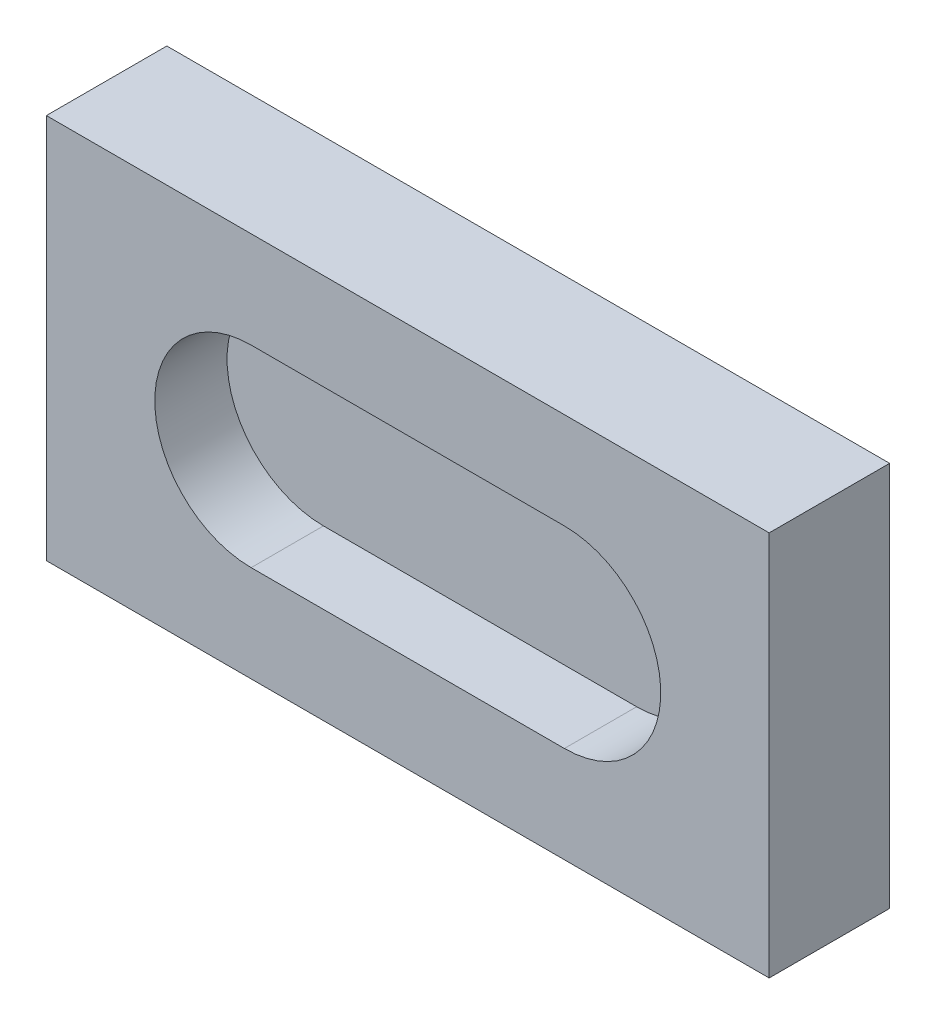
ISO-10303-21;
HEADER;
FILE_DESCRIPTION(('STEP AP214'),'2;1');
FILE_NAME('part.step','',(''),(''),'','','');
FILE_SCHEMA(('AUTOMOTIVE_DESIGN { 1 0 10303 214 1 1 1 1 }'));
ENDSEC;
DATA;
#1=APPLICATION_CONTEXT('core data for automotive mechanical design processes');
#2=APPLICATION_PROTOCOL_DEFINITION('international standard','automotive_design',2000,#1);
#3=PRODUCT_CONTEXT('',#1,'mechanical');
#4=PRODUCT('Part','Part','',(#3));
#5=PRODUCT_RELATED_PRODUCT_CATEGORY('part','',(#4));
#6=PRODUCT_DEFINITION_FORMATION('','',#4);
#7=PRODUCT_DEFINITION_CONTEXT('part definition',#1,'design');
#8=PRODUCT_DEFINITION('design','',#6,#7);
#9=PRODUCT_DEFINITION_SHAPE('','',#8);
#10=(LENGTH_UNIT() NAMED_UNIT(*) SI_UNIT(.MILLI.,.METRE.));
#11=(NAMED_UNIT(*) PLANE_ANGLE_UNIT() SI_UNIT($,.RADIAN.));
#12=(NAMED_UNIT(*) SI_UNIT($,.STERADIAN.) SOLID_ANGLE_UNIT());
#13=UNCERTAINTY_MEASURE_WITH_UNIT(LENGTH_MEASURE(1.E-05),#10,'distance_accuracy_value','');
#14=(GEOMETRIC_REPRESENTATION_CONTEXT(3) GLOBAL_UNCERTAINTY_ASSIGNED_CONTEXT((#13)) GLOBAL_UNIT_ASSIGNED_CONTEXT((#10,
#11,#12)) REPRESENTATION_CONTEXT('',''));
#15=CARTESIAN_POINT('',(0.,0.,0.));
#16=DIRECTION('',(0.,0.,1.));
#17=DIRECTION('',(1.,0.,0.));
#18=AXIS2_PLACEMENT_3D('',#15,#16,#17);
#19=CARTESIAN_POINT('',(75.,52.5,12.5000000000002));
#20=DIRECTION('',(-1.,0.,0.));
#21=DIRECTION('',(0.,-1.,0.));
#22=AXIS2_PLACEMENT_3D('',#19,#20,#21);
#23=PLANE('',#22);
#24=DIRECTION('',(0.,1.,0.));
#25=VECTOR('',#24,1.);
#26=CARTESIAN_POINT('',(75.,52.5,-12.4999999999998));
#27=LINE('',#26,#25);
#28=CARTESIAN_POINT('',(75.,-27.5,-12.5000000000001));
#29=VERTEX_POINT('',#28);
#30=CARTESIAN_POINT('',(75.,52.5,-12.4999999999998));
#31=VERTEX_POINT('',#30);
#32=EDGE_CURVE('E184',#29,#31,#27,.T.);
#33=ORIENTED_EDGE('',*,*,#32,.T.);
#34=DIRECTION('',(0.,0.,-1.));
#35=VECTOR('',#34,1.);
#36=CARTESIAN_POINT('',(75.,52.5,12.5000000000002));
#37=LINE('',#36,#35);
#38=CARTESIAN_POINT('',(75.,52.5,12.5000000000002));
#39=VERTEX_POINT('',#38);
#40=EDGE_CURVE('E12',#39,#31,#37,.T.);
#41=ORIENTED_EDGE('',*,*,#40,.F.);
#42=DIRECTION('',(0.,1.,0.));
#43=VECTOR('',#42,1.);
#44=CARTESIAN_POINT('',(75.,52.5,12.5000000000002));
#45=LINE('',#44,#43);
#46=CARTESIAN_POINT('',(75.,-27.5,12.4999999999999));
#47=VERTEX_POINT('',#46);
#48=EDGE_CURVE('E193',#47,#39,#45,.T.);
#49=ORIENTED_EDGE('',*,*,#48,.F.);
#50=DIRECTION('',(0.,0.,-1.));
#51=VECTOR('',#50,1.);
#52=CARTESIAN_POINT('',(75.,-27.5,12.4999999999999));
#53=LINE('',#52,#51);
#54=EDGE_CURVE('E203',#47,#29,#53,.T.);
#55=ORIENTED_EDGE('',*,*,#54,.T.);
#56=EDGE_LOOP('',(#33,#41,#49,#55));
#57=FACE_BOUND('',#56,.T.);
#58=ADVANCED_FACE('F48',(#57),#23,.F.);
#59=CARTESIAN_POINT('',(-75.,52.5,12.5000000000002));
#60=DIRECTION('',(0.,-1.,0.));
#61=DIRECTION('',(1.,0.,0.));
#62=AXIS2_PLACEMENT_3D('',#59,#60,#61);
#63=PLANE('',#62);
#64=DIRECTION('',(-1.,0.,0.));
#65=VECTOR('',#64,1.);
#66=CARTESIAN_POINT('',(-75.,52.5,-12.4999999999998));
#67=LINE('',#66,#65);
#68=CARTESIAN_POINT('',(-75.,52.5,-12.4999999999998));
#69=VERTEX_POINT('',#68);
#70=EDGE_CURVE('E207',#31,#69,#67,.T.);
#71=ORIENTED_EDGE('',*,*,#70,.T.);
#72=DIRECTION('',(0.,0.,-1.));
#73=VECTOR('',#72,1.);
#74=CARTESIAN_POINT('',(-75.,52.5,12.5000000000002));
#75=LINE('',#74,#73);
#76=CARTESIAN_POINT('',(-75.,52.5,12.5000000000002));
#77=VERTEX_POINT('',#76);
#78=EDGE_CURVE('E56',#77,#69,#75,.T.);
#79=ORIENTED_EDGE('',*,*,#78,.F.);
#80=DIRECTION('',(-1.,0.,0.));
#81=VECTOR('',#80,1.);
#82=CARTESIAN_POINT('',(-75.,52.5,12.5000000000002));
#83=LINE('',#82,#81);
#84=EDGE_CURVE('E100',#39,#77,#83,.T.);
#85=ORIENTED_EDGE('',*,*,#84,.F.);
#86=ORIENTED_EDGE('',*,*,#40,.T.);
#87=EDGE_LOOP('',(#71,#79,#85,#86));
#88=FACE_BOUND('',#87,.T.);
#89=ADVANCED_FACE('F242',(#88),#63,.F.);
#90=CARTESIAN_POINT('',(-75.,52.5,12.5000000000002));
#91=DIRECTION('',(1.,0.,0.));
#92=DIRECTION('',(0.,1.,0.));
#93=AXIS2_PLACEMENT_3D('',#90,#91,#92);
#94=PLANE('',#93);
#95=DIRECTION('',(0.,-1.,0.));
#96=VECTOR('',#95,1.);
#97=CARTESIAN_POINT('',(-75.,52.5,-12.4999999999998));
#98=LINE('',#97,#96);
#99=CARTESIAN_POINT('',(-75.,-27.5,-12.5000000000001));
#100=VERTEX_POINT('',#99);
#101=EDGE_CURVE('E210',#69,#100,#98,.T.);
#102=ORIENTED_EDGE('',*,*,#101,.T.);
#103=DIRECTION('',(0.,0.,-1.));
#104=VECTOR('',#103,1.);
#105=CARTESIAN_POINT('',(-75.,-27.5,12.4999999999999));
#106=LINE('',#105,#104);
#107=CARTESIAN_POINT('',(-75.,-27.5,12.4999999999999));
#108=VERTEX_POINT('',#107);
#109=EDGE_CURVE('E217',#108,#100,#106,.T.);
#110=ORIENTED_EDGE('',*,*,#109,.F.);
#111=DIRECTION('',(0.,-1.,0.));
#112=VECTOR('',#111,1.);
#113=CARTESIAN_POINT('',(-75.,52.5,12.5000000000002));
#114=LINE('',#113,#112);
#115=EDGE_CURVE('E198',#77,#108,#114,.T.);
#116=ORIENTED_EDGE('',*,*,#115,.F.);
#117=ORIENTED_EDGE('',*,*,#78,.T.);
#118=EDGE_LOOP('',(#102,#110,#116,#117));
#119=FACE_BOUND('',#118,.T.);
#120=ADVANCED_FACE('F224',(#119),#94,.F.);
#121=CARTESIAN_POINT('',(-75.,-27.5,12.4999999999999));
#122=DIRECTION('',(0.,1.,0.));
#123=DIRECTION('',(-1.,0.,0.));
#124=AXIS2_PLACEMENT_3D('',#121,#122,#123);
#125=PLANE('',#124);
#126=DIRECTION('',(1.,0.,0.));
#127=VECTOR('',#126,1.);
#128=CARTESIAN_POINT('',(-75.,-27.5,-12.5000000000001));
#129=LINE('',#128,#127);
#130=EDGE_CURVE('E93',#100,#29,#129,.T.);
#131=ORIENTED_EDGE('',*,*,#130,.T.);
#132=ORIENTED_EDGE('',*,*,#54,.F.);
#133=DIRECTION('',(1.,0.,0.));
#134=VECTOR('',#133,1.);
#135=CARTESIAN_POINT('',(-75.,-27.5,12.4999999999999));
#136=LINE('',#135,#134);
#137=EDGE_CURVE('E72',#108,#47,#136,.T.);
#138=ORIENTED_EDGE('',*,*,#137,.F.);
#139=ORIENTED_EDGE('',*,*,#109,.T.);
#140=EDGE_LOOP('',(#131,#132,#138,#139));
#141=FACE_BOUND('',#140,.T.);
#142=ADVANCED_FACE('F232',(#141),#125,.F.);
#143=CARTESIAN_POINT('',(0.,12.5,12.5));
#144=DIRECTION('',(0.,0.,1.));
#145=DIRECTION('',(0.,-1.,0.));
#146=AXIS2_PLACEMENT_3D('',#143,#144,#145);
#147=PLANE('',#146);
#148=CARTESIAN_POINT('',(-32.5,12.5,12.5));
#149=DIRECTION('',(0.,0.,1.));
#150=DIRECTION('',(0.,-1.,0.));
#151=AXIS2_PLACEMENT_3D('',#148,#149,#150);
#152=CIRCLE('',#151,20.);
#153=CARTESIAN_POINT('',(-32.5,32.5,12.5000000000001));
#154=VERTEX_POINT('',#153);
#155=CARTESIAN_POINT('',(-32.5,-7.50000000000004,12.4999999999999));
#156=VERTEX_POINT('',#155);
#157=EDGE_CURVE('E63',#154,#156,#152,.T.);
#158=ORIENTED_EDGE('',*,*,#157,.F.);
#159=DIRECTION('',(-1.,0.,0.));
#160=VECTOR('',#159,1.);
#161=CARTESIAN_POINT('',(-32.5,32.5,12.5000000000001));
#162=LINE('',#161,#160);
#163=CARTESIAN_POINT('',(32.5,32.5,12.5000000000001));
#164=VERTEX_POINT('',#163);
#165=EDGE_CURVE('E146',#164,#154,#162,.T.);
#166=ORIENTED_EDGE('',*,*,#165,.F.);
#167=CARTESIAN_POINT('',(32.5,12.5,12.5));
#168=DIRECTION('',(0.,0.,1.));
#169=DIRECTION('',(0.,-1.,0.));
#170=AXIS2_PLACEMENT_3D('',#167,#168,#169);
#171=CIRCLE('',#170,20.);
#172=CARTESIAN_POINT('',(32.5,-7.50000000000003,12.4999999999999));
#173=VERTEX_POINT('',#172);
#174=EDGE_CURVE('E150',#173,#164,#171,.T.);
#175=ORIENTED_EDGE('',*,*,#174,.F.);
#176=DIRECTION('',(1.,0.,0.));
#177=VECTOR('',#176,1.);
#178=CARTESIAN_POINT('',(-32.5,-7.50000000000004,12.4999999999999));
#179=LINE('',#178,#177);
#180=EDGE_CURVE('E171',#156,#173,#179,.T.);
#181=ORIENTED_EDGE('',*,*,#180,.F.);
#182=EDGE_LOOP('',(#158,#166,#175,#181));
#183=FACE_BOUND('',#182,.T.);
#184=ORIENTED_EDGE('',*,*,#48,.T.);
#185=ORIENTED_EDGE('',*,*,#84,.T.);
#186=ORIENTED_EDGE('',*,*,#115,.T.);
#187=ORIENTED_EDGE('',*,*,#137,.T.);
#188=EDGE_LOOP('',(#184,#185,#186,#187));
#189=FACE_BOUND('',#188,.T.);
#190=ADVANCED_FACE('F234',(#183,#189),#147,.T.);
#191=CARTESIAN_POINT('',(0.,12.5000000000001,-12.5));
#192=DIRECTION('',(0.,0.,1.));
#193=DIRECTION('',(0.,-1.,0.));
#194=AXIS2_PLACEMENT_3D('',#191,#192,#193);
#195=PLANE('',#194);
#196=ORIENTED_EDGE('',*,*,#32,.F.);
#197=ORIENTED_EDGE('',*,*,#130,.F.);
#198=ORIENTED_EDGE('',*,*,#101,.F.);
#199=ORIENTED_EDGE('',*,*,#70,.F.);
#200=EDGE_LOOP('',(#196,#197,#198,#199));
#201=FACE_BOUND('',#200,.T.);
#202=ADVANCED_FACE('F228',(#201),#195,.F.);
#203=CARTESIAN_POINT('',(-32.5,12.5,-2.49999999999998));
#204=DIRECTION('',(0.,0.,1.));
#205=DIRECTION('',(0.,-1.,0.));
#206=AXIS2_PLACEMENT_3D('',#203,#204,#205);
#207=CYLINDRICAL_SURFACE('',#206,20.);
#208=ORIENTED_EDGE('',*,*,#157,.T.);
#209=DIRECTION('',(0.,0.,1.));
#210=VECTOR('',#209,1.);
#211=CARTESIAN_POINT('',(-32.5,-7.49999999999998,-2.50000000000005));
#212=LINE('',#211,#210);
#213=CARTESIAN_POINT('',(-32.5,-7.49999999999998,-2.50000000000005));
#214=VERTEX_POINT('',#213);
#215=EDGE_CURVE('E120',#214,#156,#212,.T.);
#216=ORIENTED_EDGE('',*,*,#215,.F.);
#217=CARTESIAN_POINT('',(-32.5,12.5,-2.49999999999998));
#218=DIRECTION('',(0.,0.,1.));
#219=DIRECTION('',(0.,-1.,0.));
#220=AXIS2_PLACEMENT_3D('',#217,#218,#219);
#221=CIRCLE('',#220,20.);
#222=CARTESIAN_POINT('',(-32.5,32.5,-2.49999999999992));
#223=VERTEX_POINT('',#222);
#224=EDGE_CURVE('E124',#223,#214,#221,.T.);
#225=ORIENTED_EDGE('',*,*,#224,.F.);
#226=DIRECTION('',(0.,0.,1.));
#227=VECTOR('',#226,1.);
#228=CARTESIAN_POINT('',(-32.5,32.5,-2.49999999999992));
#229=LINE('',#228,#227);
#230=EDGE_CURVE('E181',#223,#154,#229,.T.);
#231=ORIENTED_EDGE('',*,*,#230,.T.);
#232=EDGE_LOOP('',(#208,#216,#225,#231));
#233=FACE_BOUND('',#232,.T.);
#234=ADVANCED_FACE('F122',(#233),#207,.F.);
#235=CARTESIAN_POINT('',(-32.5,32.5,-2.49999999999992));
#236=DIRECTION('',(0.,1.,0.));
#237=DIRECTION('',(-1.,0.,0.));
#238=AXIS2_PLACEMENT_3D('',#235,#236,#237);
#239=PLANE('',#238);
#240=ORIENTED_EDGE('',*,*,#165,.T.);
#241=ORIENTED_EDGE('',*,*,#230,.F.);
#242=DIRECTION('',(-1.,0.,0.));
#243=VECTOR('',#242,1.);
#244=CARTESIAN_POINT('',(-32.5,32.5,-2.49999999999992));
#245=LINE('',#244,#243);
#246=CARTESIAN_POINT('',(32.5,32.5,-2.49999999999992));
#247=VERTEX_POINT('',#246);
#248=EDGE_CURVE('E131',#247,#223,#245,.T.);
#249=ORIENTED_EDGE('',*,*,#248,.F.);
#250=DIRECTION('',(0.,0.,1.));
#251=VECTOR('',#250,1.);
#252=CARTESIAN_POINT('',(32.5,32.5,-2.49999999999992));
#253=LINE('',#252,#251);
#254=EDGE_CURVE('E185',#247,#164,#253,.T.);
#255=ORIENTED_EDGE('',*,*,#254,.T.);
#256=EDGE_LOOP('',(#240,#241,#249,#255));
#257=FACE_BOUND('',#256,.T.);
#258=ADVANCED_FACE('F277',(#257),#239,.F.);
#259=CARTESIAN_POINT('',(32.5,12.5,-2.49999999999998));
#260=DIRECTION('',(0.,0.,1.));
#261=DIRECTION('',(0.,-1.,0.));
#262=AXIS2_PLACEMENT_3D('',#259,#260,#261);
#263=CYLINDRICAL_SURFACE('',#262,20.);
#264=ORIENTED_EDGE('',*,*,#174,.T.);
#265=ORIENTED_EDGE('',*,*,#254,.F.);
#266=CARTESIAN_POINT('',(32.5,12.5,-2.49999999999998));
#267=DIRECTION('',(0.,0.,1.));
#268=DIRECTION('',(0.,-1.,0.));
#269=AXIS2_PLACEMENT_3D('',#266,#267,#268);
#270=CIRCLE('',#269,20.);
#271=CARTESIAN_POINT('',(32.5,-7.49999999999998,-2.50000000000005));
#272=VERTEX_POINT('',#271);
#273=EDGE_CURVE('E140',#272,#247,#270,.T.);
#274=ORIENTED_EDGE('',*,*,#273,.F.);
#275=DIRECTION('',(0.,0.,1.));
#276=VECTOR('',#275,1.);
#277=CARTESIAN_POINT('',(32.5,-7.49999999999998,-2.50000000000005));
#278=LINE('',#277,#276);
#279=EDGE_CURVE('E130',#272,#173,#278,.T.);
#280=ORIENTED_EDGE('',*,*,#279,.T.);
#281=EDGE_LOOP('',(#264,#265,#274,#280));
#282=FACE_BOUND('',#281,.T.);
#283=ADVANCED_FACE('F288',(#282),#263,.F.);
#284=CARTESIAN_POINT('',(-32.5,-7.49999999999998,-2.50000000000005));
#285=DIRECTION('',(0.,-1.,0.));
#286=DIRECTION('',(1.,0.,0.));
#287=AXIS2_PLACEMENT_3D('',#284,#285,#286);
#288=PLANE('',#287);
#289=ORIENTED_EDGE('',*,*,#180,.T.);
#290=ORIENTED_EDGE('',*,*,#279,.F.);
#291=DIRECTION('',(1.,0.,0.));
#292=VECTOR('',#291,1.);
#293=CARTESIAN_POINT('',(-32.5,-7.49999999999998,-2.50000000000005));
#294=LINE('',#293,#292);
#295=EDGE_CURVE('E134',#214,#272,#294,.T.);
#296=ORIENTED_EDGE('',*,*,#295,.F.);
#297=ORIENTED_EDGE('',*,*,#215,.T.);
#298=EDGE_LOOP('',(#289,#290,#296,#297));
#299=FACE_BOUND('',#298,.T.);
#300=ADVANCED_FACE('F135',(#299),#288,.F.);
#301=CARTESIAN_POINT('',(-32.5,12.5,-2.49999999999998));
#302=DIRECTION('',(0.,0.,1.));
#303=DIRECTION('',(0.,-1.,0.));
#304=AXIS2_PLACEMENT_3D('',#301,#302,#303);
#305=PLANE('',#304);
#306=ORIENTED_EDGE('',*,*,#224,.T.);
#307=ORIENTED_EDGE('',*,*,#295,.T.);
#308=ORIENTED_EDGE('',*,*,#273,.T.);
#309=ORIENTED_EDGE('',*,*,#248,.T.);
#310=EDGE_LOOP('',(#306,#307,#308,#309));
#311=FACE_BOUND('',#310,.T.);
#312=ADVANCED_FACE('F143',(#311),#305,.T.);
#313=CLOSED_SHELL('',(#58,#89,#120,#142,#190,#202,#234,#258,#283,#300,#312));
#314=MANIFOLD_SOLID_BREP('B2',#313);
#315=ADVANCED_BREP_SHAPE_REPRESENTATION('',(#18,#314),#14);
#316=SHAPE_DEFINITION_REPRESENTATION(#9,#315);
ENDSEC;
END-ISO-10303-21;
